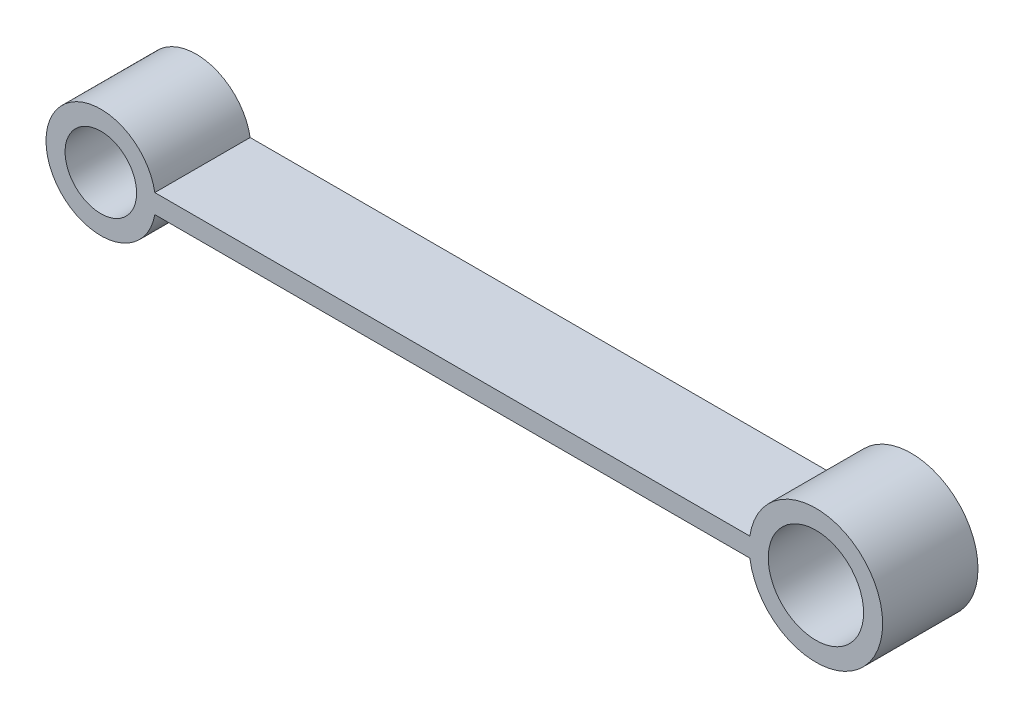
ISO-10303-21;
HEADER;
FILE_DESCRIPTION(('STEP AP214'),'2;1');
FILE_NAME('part.step','',(''),(''),'','','');
FILE_SCHEMA(('AUTOMOTIVE_DESIGN { 1 0 10303 214 1 1 1 1 }'));
ENDSEC;
DATA;
#1=APPLICATION_CONTEXT('core data for automotive mechanical design processes');
#2=APPLICATION_PROTOCOL_DEFINITION('international standard','automotive_design',2000,#1);
#3=PRODUCT_CONTEXT('',#1,'mechanical');
#4=PRODUCT('Part','Part','',(#3));
#5=PRODUCT_RELATED_PRODUCT_CATEGORY('part','',(#4));
#6=PRODUCT_DEFINITION_FORMATION('','',#4);
#7=PRODUCT_DEFINITION_CONTEXT('part definition',#1,'design');
#8=PRODUCT_DEFINITION('design','',#6,#7);
#9=PRODUCT_DEFINITION_SHAPE('','',#8);
#10=(LENGTH_UNIT() NAMED_UNIT(*) SI_UNIT(.MILLI.,.METRE.));
#11=(NAMED_UNIT(*) PLANE_ANGLE_UNIT() SI_UNIT($,.RADIAN.));
#12=(NAMED_UNIT(*) SI_UNIT($,.STERADIAN.) SOLID_ANGLE_UNIT());
#13=UNCERTAINTY_MEASURE_WITH_UNIT(LENGTH_MEASURE(1.E-05),#10,'distance_accuracy_value','');
#14=(GEOMETRIC_REPRESENTATION_CONTEXT(3) GLOBAL_UNCERTAINTY_ASSIGNED_CONTEXT((#13)) GLOBAL_UNIT_ASSIGNED_CONTEXT((#10,
#11,#12)) REPRESENTATION_CONTEXT('',''));
#15=CARTESIAN_POINT('',(0.,0.,0.));
#16=DIRECTION('',(0.,0.,1.));
#17=DIRECTION('',(1.,0.,0.));
#18=AXIS2_PLACEMENT_3D('',#15,#16,#17);
#19=CARTESIAN_POINT('',(-42.3,42.3,-10.));
#20=DIRECTION('',(0.,0.,1.));
#21=DIRECTION('',(1.,0.,0.));
#22=AXIS2_PLACEMENT_3D('',#19,#20,#21);
#23=CYLINDRICAL_SURFACE('',#22,5.);
#24=CARTESIAN_POINT('',(-42.3,42.3,0.));
#25=DIRECTION('',(0.,0.,1.));
#26=DIRECTION('',(1.,0.,0.));
#27=AXIS2_PLACEMENT_3D('',#24,#25,#26);
#28=CIRCLE('',#27,5.);
#29=CARTESIAN_POINT('',(-37.3,42.3,0.));
#30=VERTEX_POINT('',#29);
#31=EDGE_CURVE('E105',#30,#30,#28,.T.);
#32=ORIENTED_EDGE('',*,*,#31,.T.);
#33=EDGE_LOOP('',(#32));
#34=FACE_BOUND('',#33,.T.);
#35=CARTESIAN_POINT('',(-42.3,42.3,-10.));
#36=DIRECTION('',(0.,0.,1.));
#37=DIRECTION('',(1.,0.,0.));
#38=AXIS2_PLACEMENT_3D('',#35,#36,#37);
#39=CIRCLE('',#38,5.);
#40=CARTESIAN_POINT('',(-37.3,42.3,-10.));
#41=VERTEX_POINT('',#40);
#42=EDGE_CURVE('E107',#41,#41,#39,.T.);
#43=ORIENTED_EDGE('',*,*,#42,.F.);
#44=EDGE_LOOP('',(#43));
#45=FACE_BOUND('',#44,.T.);
#46=ADVANCED_FACE('F35',(#34,#45),#23,.F.);
#47=CARTESIAN_POINT('',(0.,41.3,-10.));
#48=DIRECTION('',(0.,-1.,0.));
#49=DIRECTION('',(1.,0.,0.));
#50=AXIS2_PLACEMENT_3D('',#47,#48,#49);
#51=PLANE('',#50);
#52=DIRECTION('',(0.,0.,1.));
#53=VECTOR('',#52,1.);
#54=CARTESIAN_POINT('',(-111.637624173547,41.3,-10.));
#55=LINE('',#54,#53);
#56=CARTESIAN_POINT('',(-111.637624173547,41.3,-10.));
#57=VERTEX_POINT('',#56);
#58=CARTESIAN_POINT('',(-111.637624173547,41.3,0.));
#59=VERTEX_POINT('',#58);
#60=EDGE_CURVE('E79',#57,#59,#55,.T.);
#61=ORIENTED_EDGE('',*,*,#60,.F.);
#62=DIRECTION('',(1.,0.,0.));
#63=VECTOR('',#62,1.);
#64=CARTESIAN_POINT('',(0.,41.3,-10.));
#65=LINE('',#64,#63);
#66=CARTESIAN_POINT('',(-49.2282032302755,41.3,-10.));
#67=VERTEX_POINT('',#66);
#68=EDGE_CURVE('E11',#57,#67,#65,.T.);
#69=ORIENTED_EDGE('',*,*,#68,.T.);
#70=DIRECTION('',(0.,0.,1.));
#71=VECTOR('',#70,1.);
#72=CARTESIAN_POINT('',(-49.2282032302755,41.3,-10.));
#73=LINE('',#72,#71);
#74=CARTESIAN_POINT('',(-49.2282032302755,41.3,0.));
#75=VERTEX_POINT('',#74);
#76=EDGE_CURVE('E98',#67,#75,#73,.T.);
#77=ORIENTED_EDGE('',*,*,#76,.T.);
#78=DIRECTION('',(1.,0.,0.));
#79=VECTOR('',#78,1.);
#80=CARTESIAN_POINT('',(0.,41.3,0.));
#81=LINE('',#80,#79);
#82=EDGE_CURVE('E38',#59,#75,#81,.T.);
#83=ORIENTED_EDGE('',*,*,#82,.F.);
#84=EDGE_LOOP('',(#61,#69,#77,#83));
#85=FACE_BOUND('',#84,.T.);
#86=ADVANCED_FACE('F87',(#85),#51,.T.);
#87=CARTESIAN_POINT('',(-117.3,42.3,-10.));
#88=DIRECTION('',(0.,0.,1.));
#89=DIRECTION('',(1.,0.,0.));
#90=AXIS2_PLACEMENT_3D('',#87,#88,#89);
#91=CYLINDRICAL_SURFACE('',#90,3.75000000000001);
#92=CARTESIAN_POINT('',(-117.3,42.3,0.));
#93=DIRECTION('',(0.,0.,1.));
#94=DIRECTION('',(1.,0.,0.));
#95=AXIS2_PLACEMENT_3D('',#92,#93,#94);
#96=CIRCLE('',#95,3.75000000000001);
#97=CARTESIAN_POINT('',(-113.55,42.3,0.));
#98=VERTEX_POINT('',#97);
#99=EDGE_CURVE('E116',#98,#98,#96,.T.);
#100=ORIENTED_EDGE('',*,*,#99,.T.);
#101=EDGE_LOOP('',(#100));
#102=FACE_BOUND('',#101,.T.);
#103=CARTESIAN_POINT('',(-117.3,42.3,-10.));
#104=DIRECTION('',(0.,0.,1.));
#105=DIRECTION('',(1.,0.,0.));
#106=AXIS2_PLACEMENT_3D('',#103,#104,#105);
#107=CIRCLE('',#106,3.75000000000001);
#108=CARTESIAN_POINT('',(-113.55,42.3,-10.));
#109=VERTEX_POINT('',#108);
#110=EDGE_CURVE('E43',#109,#109,#107,.T.);
#111=ORIENTED_EDGE('',*,*,#110,.F.);
#112=EDGE_LOOP('',(#111));
#113=FACE_BOUND('',#112,.T.);
#114=ADVANCED_FACE('F128',(#102,#113),#91,.F.);
#115=CARTESIAN_POINT('',(0.,43.3,-10.));
#116=DIRECTION('',(0.,1.,0.));
#117=DIRECTION('',(-1.,0.,0.));
#118=AXIS2_PLACEMENT_3D('',#115,#116,#117);
#119=PLANE('',#118);
#120=DIRECTION('',(0.,0.,1.));
#121=VECTOR('',#120,1.);
#122=CARTESIAN_POINT('',(-111.637624173547,43.3,-10.));
#123=LINE('',#122,#121);
#124=CARTESIAN_POINT('',(-111.637624173547,43.3,0.));
#125=VERTEX_POINT('',#124);
#126=CARTESIAN_POINT('',(-111.637624173547,43.3,-10.));
#127=VERTEX_POINT('',#126);
#128=EDGE_CURVE('E55',#125,#127,#123,.F.);
#129=ORIENTED_EDGE('',*,*,#128,.F.);
#130=DIRECTION('',(-1.,0.,0.));
#131=VECTOR('',#130,1.);
#132=CARTESIAN_POINT('',(0.,43.3,0.));
#133=LINE('',#132,#131);
#134=CARTESIAN_POINT('',(-49.2282032302755,43.3,0.));
#135=VERTEX_POINT('',#134);
#136=EDGE_CURVE('E115',#135,#125,#133,.T.);
#137=ORIENTED_EDGE('',*,*,#136,.F.);
#138=DIRECTION('',(0.,0.,1.));
#139=VECTOR('',#138,1.);
#140=CARTESIAN_POINT('',(-49.2282032302755,43.3,-10.));
#141=LINE('',#140,#139);
#142=CARTESIAN_POINT('',(-49.2282032302755,43.3,-10.));
#143=VERTEX_POINT('',#142);
#144=EDGE_CURVE('E100',#143,#135,#141,.T.);
#145=ORIENTED_EDGE('',*,*,#144,.F.);
#146=DIRECTION('',(-1.,0.,0.));
#147=VECTOR('',#146,1.);
#148=CARTESIAN_POINT('',(0.,43.3,-10.));
#149=LINE('',#148,#147);
#150=EDGE_CURVE('E51',#143,#127,#149,.T.);
#151=ORIENTED_EDGE('',*,*,#150,.T.);
#152=EDGE_LOOP('',(#129,#137,#145,#151));
#153=FACE_BOUND('',#152,.T.);
#154=ADVANCED_FACE('F125',(#153),#119,.T.);
#155=CARTESIAN_POINT('',(0.,0.,-10.));
#156=DIRECTION('',(0.,0.,1.));
#157=DIRECTION('',(1.,0.,0.));
#158=AXIS2_PLACEMENT_3D('',#155,#156,#157);
#159=PLANE('',#158);
#160=ORIENTED_EDGE('',*,*,#68,.F.);
#161=CARTESIAN_POINT('',(-117.3,42.3,-10.));
#162=DIRECTION('',(0.,0.,1.));
#163=DIRECTION('',(1.,0.,0.));
#164=AXIS2_PLACEMENT_3D('',#161,#162,#163);
#165=CIRCLE('',#164,5.75);
#166=EDGE_CURVE('E75',#127,#57,#165,.T.);
#167=ORIENTED_EDGE('',*,*,#166,.F.);
#168=ORIENTED_EDGE('',*,*,#150,.F.);
#169=CARTESIAN_POINT('',(-42.3,42.3,-10.));
#170=DIRECTION('',(0.,0.,1.));
#171=DIRECTION('',(1.,0.,0.));
#172=AXIS2_PLACEMENT_3D('',#169,#170,#171);
#173=CIRCLE('',#172,7.);
#174=EDGE_CURVE('E95',#67,#143,#173,.T.);
#175=ORIENTED_EDGE('',*,*,#174,.F.);
#176=EDGE_LOOP('',(#160,#167,#168,#175));
#177=FACE_BOUND('',#176,.T.);
#178=ORIENTED_EDGE('',*,*,#42,.T.);
#179=EDGE_LOOP('',(#178));
#180=FACE_BOUND('',#179,.T.);
#181=ORIENTED_EDGE('',*,*,#110,.T.);
#182=EDGE_LOOP('',(#181));
#183=FACE_BOUND('',#182,.T.);
#184=ADVANCED_FACE('F93',(#177,#180,#183),#159,.F.);
#185=CARTESIAN_POINT('',(0.,0.,0.));
#186=DIRECTION('',(0.,0.,1.));
#187=DIRECTION('',(1.,0.,0.));
#188=AXIS2_PLACEMENT_3D('',#185,#186,#187);
#189=PLANE('',#188);
#190=CARTESIAN_POINT('',(-117.3,42.3,0.));
#191=DIRECTION('',(0.,0.,1.));
#192=DIRECTION('',(1.,0.,0.));
#193=AXIS2_PLACEMENT_3D('',#190,#191,#192);
#194=CIRCLE('',#193,5.75);
#195=EDGE_CURVE('E83',#125,#59,#194,.T.);
#196=ORIENTED_EDGE('',*,*,#195,.T.);
#197=ORIENTED_EDGE('',*,*,#82,.T.);
#198=CARTESIAN_POINT('',(-42.3,42.3,0.));
#199=DIRECTION('',(0.,0.,1.));
#200=DIRECTION('',(1.,0.,0.));
#201=AXIS2_PLACEMENT_3D('',#198,#199,#200);
#202=CIRCLE('',#201,7.);
#203=EDGE_CURVE('E90',#75,#135,#202,.T.);
#204=ORIENTED_EDGE('',*,*,#203,.T.);
#205=ORIENTED_EDGE('',*,*,#136,.T.);
#206=EDGE_LOOP('',(#196,#197,#204,#205));
#207=FACE_BOUND('',#206,.T.);
#208=ORIENTED_EDGE('',*,*,#99,.F.);
#209=EDGE_LOOP('',(#208));
#210=FACE_BOUND('',#209,.T.);
#211=ORIENTED_EDGE('',*,*,#31,.F.);
#212=EDGE_LOOP('',(#211));
#213=FACE_BOUND('',#212,.T.);
#214=ADVANCED_FACE('F122',(#207,#210,#213),#189,.T.);
#215=CARTESIAN_POINT('',(-42.3,42.3,-10.));
#216=DIRECTION('',(0.,0.,1.));
#217=DIRECTION('',(1.,0.,0.));
#218=AXIS2_PLACEMENT_3D('',#215,#216,#217);
#219=CYLINDRICAL_SURFACE('',#218,7.);
#220=ORIENTED_EDGE('',*,*,#203,.F.);
#221=ORIENTED_EDGE('',*,*,#76,.F.);
#222=ORIENTED_EDGE('',*,*,#174,.T.);
#223=ORIENTED_EDGE('',*,*,#144,.T.);
#224=EDGE_LOOP('',(#220,#221,#222,#223));
#225=FACE_BOUND('',#224,.T.);
#226=ADVANCED_FACE('F124',(#225),#219,.T.);
#227=CARTESIAN_POINT('',(-117.3,42.3,-10.));
#228=DIRECTION('',(0.,0.,1.));
#229=DIRECTION('',(1.,0.,0.));
#230=AXIS2_PLACEMENT_3D('',#227,#228,#229);
#231=CYLINDRICAL_SURFACE('',#230,5.75);
#232=ORIENTED_EDGE('',*,*,#166,.T.);
#233=ORIENTED_EDGE('',*,*,#60,.T.);
#234=ORIENTED_EDGE('',*,*,#195,.F.);
#235=ORIENTED_EDGE('',*,*,#128,.T.);
#236=EDGE_LOOP('',(#232,#233,#234,#235));
#237=FACE_BOUND('',#236,.T.);
#238=ADVANCED_FACE('F77',(#237),#231,.T.);
#239=CLOSED_SHELL('',(#46,#86,#114,#154,#184,#214,#226,#238));
#240=MANIFOLD_SOLID_BREP('B2',#239);
#241=ADVANCED_BREP_SHAPE_REPRESENTATION('',(#18,#240),#14);
#242=SHAPE_DEFINITION_REPRESENTATION(#9,#241);
ENDSEC;
END-ISO-10303-21;
